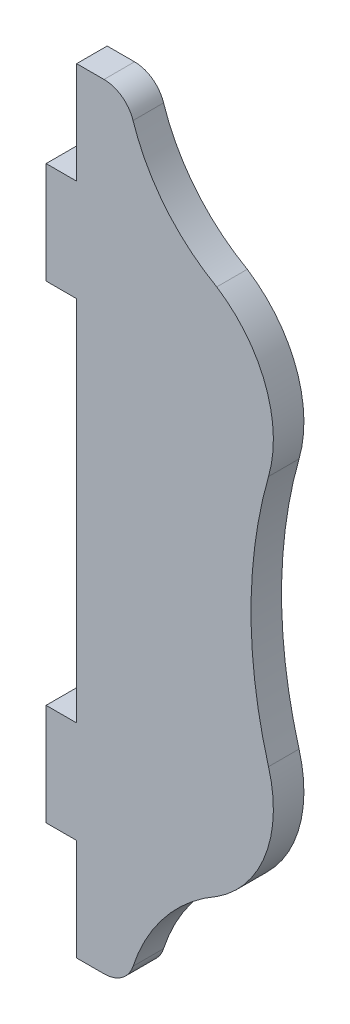
ISO-10303-21;
HEADER;
FILE_DESCRIPTION(('STEP AP214'),'2;1');
FILE_NAME('part.step','',(''),(''),'','','');
FILE_SCHEMA(('AUTOMOTIVE_DESIGN { 1 0 10303 214 1 1 1 1 }'));
ENDSEC;
DATA;
#1=APPLICATION_CONTEXT('core data for automotive mechanical design processes');
#2=APPLICATION_PROTOCOL_DEFINITION('international standard','automotive_design',2000,#1);
#3=PRODUCT_CONTEXT('',#1,'mechanical');
#4=PRODUCT('Part','Part','',(#3));
#5=PRODUCT_RELATED_PRODUCT_CATEGORY('part','',(#4));
#6=PRODUCT_DEFINITION_FORMATION('','',#4);
#7=PRODUCT_DEFINITION_CONTEXT('part definition',#1,'design');
#8=PRODUCT_DEFINITION('design','',#6,#7);
#9=PRODUCT_DEFINITION_SHAPE('','',#8);
#10=(LENGTH_UNIT() NAMED_UNIT(*) SI_UNIT(.MILLI.,.METRE.));
#11=(NAMED_UNIT(*) PLANE_ANGLE_UNIT() SI_UNIT($,.RADIAN.));
#12=(NAMED_UNIT(*) SI_UNIT($,.STERADIAN.) SOLID_ANGLE_UNIT());
#13=UNCERTAINTY_MEASURE_WITH_UNIT(LENGTH_MEASURE(1.E-05),#10,'distance_accuracy_value','');
#14=(GEOMETRIC_REPRESENTATION_CONTEXT(3) GLOBAL_UNCERTAINTY_ASSIGNED_CONTEXT((#13)) GLOBAL_UNIT_ASSIGNED_CONTEXT((#10,
#11,#12)) REPRESENTATION_CONTEXT('',''));
#15=CARTESIAN_POINT('',(0.,0.,0.));
#16=DIRECTION('',(0.,0.,1.));
#17=DIRECTION('',(1.,0.,0.));
#18=AXIS2_PLACEMENT_3D('',#15,#16,#17);
#19=CARTESIAN_POINT('',(28.178792169495,53.4241314614055,3.));
#20=DIRECTION('',(0.,0.,-1.));
#21=DIRECTION('',(-1.,0.,0.));
#22=AXIS2_PLACEMENT_3D('',#19,#20,#21);
#23=CYLINDRICAL_SURFACE('',#22,3.);
#24=CARTESIAN_POINT('',(28.178792169495,53.4241314614055,0.));
#25=DIRECTION('',(0.,0.,1.));
#26=DIRECTION('',(1.,0.,0.));
#27=AXIS2_PLACEMENT_3D('',#24,#25,#26);
#28=CIRCLE('',#27,3.);
#29=CARTESIAN_POINT('',(31.0304509541719,54.355819271659,0.));
#30=VERTEX_POINT('',#29);
#31=CARTESIAN_POINT('',(28.178792169495,56.4241314614055,0.));
#32=VERTEX_POINT('',#31);
#33=EDGE_CURVE('E189',#30,#32,#28,.T.);
#34=ORIENTED_EDGE('',*,*,#33,.T.);
#35=DIRECTION('',(0.,0.,-1.));
#36=VECTOR('',#35,1.);
#37=CARTESIAN_POINT('',(28.178792169495,56.4241314614055,3.));
#38=LINE('',#37,#36);
#39=CARTESIAN_POINT('',(28.178792169495,56.4241314614055,3.));
#40=VERTEX_POINT('',#39);
#41=EDGE_CURVE('E11',#40,#32,#38,.T.);
#42=ORIENTED_EDGE('',*,*,#41,.F.);
#43=CARTESIAN_POINT('',(28.178792169495,53.4241314614055,3.));
#44=DIRECTION('',(0.,0.,1.));
#45=DIRECTION('',(1.,0.,0.));
#46=AXIS2_PLACEMENT_3D('',#43,#44,#45);
#47=CIRCLE('',#46,3.);
#48=CARTESIAN_POINT('',(31.0304509541719,54.355819271659,3.));
#49=VERTEX_POINT('',#48);
#50=EDGE_CURVE('E223',#49,#40,#47,.T.);
#51=ORIENTED_EDGE('',*,*,#50,.F.);
#52=DIRECTION('',(0.,0.,-1.));
#53=VECTOR('',#52,1.);
#54=CARTESIAN_POINT('',(31.0304509541719,54.355819271659,3.));
#55=LINE('',#54,#53);
#56=EDGE_CURVE('E185',#49,#30,#55,.T.);
#57=ORIENTED_EDGE('',*,*,#56,.T.);
#58=EDGE_LOOP('',(#34,#42,#51,#57));
#59=FACE_BOUND('',#58,.T.);
#60=ADVANCED_FACE('F33',(#59),#23,.T.);
#61=CARTESIAN_POINT('',(25.4887162751569,56.4241314614055,3.));
#62=DIRECTION('',(0.,-1.,0.));
#63=DIRECTION('',(0.,0.,-1.));
#64=AXIS2_PLACEMENT_3D('',#61,#62,#63);
#65=PLANE('',#64);
#66=DIRECTION('',(-1.,0.,0.));
#67=VECTOR('',#66,1.);
#68=CARTESIAN_POINT('',(25.4887162751569,56.4241314614055,0.));
#69=LINE('',#68,#67);
#70=CARTESIAN_POINT('',(25.4887162751569,56.4241314614055,0.));
#71=VERTEX_POINT('',#70);
#72=EDGE_CURVE('E192',#32,#71,#69,.T.);
#73=ORIENTED_EDGE('',*,*,#72,.T.);
#74=DIRECTION('',(0.,0.,-1.));
#75=VECTOR('',#74,1.);
#76=CARTESIAN_POINT('',(25.4887162751569,56.4241314614055,3.));
#77=LINE('',#76,#75);
#78=CARTESIAN_POINT('',(25.4887162751569,56.4241314614055,3.));
#79=VERTEX_POINT('',#78);
#80=EDGE_CURVE('E41',#79,#71,#77,.T.);
#81=ORIENTED_EDGE('',*,*,#80,.F.);
#82=DIRECTION('',(-1.,0.,0.));
#83=VECTOR('',#82,1.);
#84=CARTESIAN_POINT('',(25.4887162751569,56.4241314614055,3.));
#85=LINE('',#84,#83);
#86=EDGE_CURVE('E122',#40,#79,#85,.T.);
#87=ORIENTED_EDGE('',*,*,#86,.F.);
#88=ORIENTED_EDGE('',*,*,#41,.T.);
#89=EDGE_LOOP('',(#73,#81,#87,#88));
#90=FACE_BOUND('',#89,.T.);
#91=ADVANCED_FACE('F331',(#90),#65,.F.);
#92=CARTESIAN_POINT('',(25.4887162751569,46.4241314614055,3.));
#93=DIRECTION('',(1.,0.,0.));
#94=DIRECTION('',(0.,0.,-1.));
#95=AXIS2_PLACEMENT_3D('',#92,#93,#94);
#96=PLANE('',#95);
#97=DIRECTION('',(0.,-1.,0.));
#98=VECTOR('',#97,1.);
#99=CARTESIAN_POINT('',(25.4887162751569,46.4241314614055,0.));
#100=LINE('',#99,#98);
#101=CARTESIAN_POINT('',(25.4887162751569,46.4241314614055,0.));
#102=VERTEX_POINT('',#101);
#103=EDGE_CURVE('E194',#71,#102,#100,.T.);
#104=ORIENTED_EDGE('',*,*,#103,.T.);
#105=DIRECTION('',(0.,0.,-1.));
#106=VECTOR('',#105,1.);
#107=CARTESIAN_POINT('',(25.4887162751569,46.4241314614055,3.));
#108=LINE('',#107,#106);
#109=CARTESIAN_POINT('',(25.4887162751569,46.4241314614055,3.));
#110=VERTEX_POINT('',#109);
#111=EDGE_CURVE('E260',#110,#102,#108,.T.);
#112=ORIENTED_EDGE('',*,*,#111,.F.);
#113=DIRECTION('',(0.,-1.,0.));
#114=VECTOR('',#113,1.);
#115=CARTESIAN_POINT('',(25.4887162751569,46.4241314614055,3.));
#116=LINE('',#115,#114);
#117=EDGE_CURVE('E268',#79,#110,#116,.T.);
#118=ORIENTED_EDGE('',*,*,#117,.F.);
#119=ORIENTED_EDGE('',*,*,#80,.T.);
#120=EDGE_LOOP('',(#104,#112,#118,#119));
#121=FACE_BOUND('',#120,.T.);
#122=ADVANCED_FACE('F266',(#121),#96,.F.);
#123=CARTESIAN_POINT('',(22.4887162751569,46.4241314614055,3.));
#124=DIRECTION('',(0.,-1.,0.));
#125=DIRECTION('',(0.,0.,-1.));
#126=AXIS2_PLACEMENT_3D('',#123,#124,#125);
#127=PLANE('',#126);
#128=DIRECTION('',(-1.,0.,0.));
#129=VECTOR('',#128,1.);
#130=CARTESIAN_POINT('',(22.4887162751569,46.4241314614055,0.));
#131=LINE('',#130,#129);
#132=CARTESIAN_POINT('',(22.4887162751569,46.4241314614055,0.));
#133=VERTEX_POINT('',#132);
#134=EDGE_CURVE('E196',#102,#133,#131,.T.);
#135=ORIENTED_EDGE('',*,*,#134,.T.);
#136=DIRECTION('',(0.,0.,-1.));
#137=VECTOR('',#136,1.);
#138=CARTESIAN_POINT('',(22.4887162751569,46.4241314614055,3.));
#139=LINE('',#138,#137);
#140=CARTESIAN_POINT('',(22.4887162751569,46.4241314614055,3.));
#141=VERTEX_POINT('',#140);
#142=EDGE_CURVE('E257',#141,#133,#139,.T.);
#143=ORIENTED_EDGE('',*,*,#142,.F.);
#144=DIRECTION('',(-1.,0.,0.));
#145=VECTOR('',#144,1.);
#146=CARTESIAN_POINT('',(22.4887162751569,46.4241314614055,3.));
#147=LINE('',#146,#145);
#148=EDGE_CURVE('E286',#110,#141,#147,.T.);
#149=ORIENTED_EDGE('',*,*,#148,.F.);
#150=ORIENTED_EDGE('',*,*,#111,.T.);
#151=EDGE_LOOP('',(#135,#143,#149,#150));
#152=FACE_BOUND('',#151,.T.);
#153=ADVANCED_FACE('F277',(#152),#127,.F.);
#154=CARTESIAN_POINT('',(22.4887162751569,46.4241314614055,3.));
#155=DIRECTION('',(1.,0.,0.));
#156=DIRECTION('',(0.,0.,-1.));
#157=AXIS2_PLACEMENT_3D('',#154,#155,#156);
#158=PLANE('',#157);
#159=DIRECTION('',(0.,-1.,0.));
#160=VECTOR('',#159,1.);
#161=CARTESIAN_POINT('',(22.4887162751569,46.4241314614055,0.));
#162=LINE('',#161,#160);
#163=CARTESIAN_POINT('',(22.4887162751569,36.4241314614055,0.));
#164=VERTEX_POINT('',#163);
#165=EDGE_CURVE('E198',#133,#164,#162,.T.);
#166=ORIENTED_EDGE('',*,*,#165,.T.);
#167=DIRECTION('',(0.,0.,-1.));
#168=VECTOR('',#167,1.);
#169=CARTESIAN_POINT('',(22.4887162751569,36.4241314614055,3.));
#170=LINE('',#169,#168);
#171=CARTESIAN_POINT('',(22.4887162751569,36.4241314614055,3.));
#172=VERTEX_POINT('',#171);
#173=EDGE_CURVE('E254',#172,#164,#170,.T.);
#174=ORIENTED_EDGE('',*,*,#173,.F.);
#175=DIRECTION('',(0.,-1.,0.));
#176=VECTOR('',#175,1.);
#177=CARTESIAN_POINT('',(22.4887162751569,46.4241314614055,3.));
#178=LINE('',#177,#176);
#179=EDGE_CURVE('E283',#141,#172,#178,.T.);
#180=ORIENTED_EDGE('',*,*,#179,.F.);
#181=ORIENTED_EDGE('',*,*,#142,.T.);
#182=EDGE_LOOP('',(#166,#174,#180,#181));
#183=FACE_BOUND('',#182,.T.);
#184=ADVANCED_FACE('F281',(#183),#158,.F.);
#185=CARTESIAN_POINT('',(25.4887162751569,36.4241314614055,3.));
#186=DIRECTION('',(0.,1.,0.));
#187=DIRECTION('',(0.,0.,1.));
#188=AXIS2_PLACEMENT_3D('',#185,#186,#187);
#189=PLANE('',#188);
#190=DIRECTION('',(1.,0.,0.));
#191=VECTOR('',#190,1.);
#192=CARTESIAN_POINT('',(25.4887162751569,36.4241314614055,0.));
#193=LINE('',#192,#191);
#194=CARTESIAN_POINT('',(25.4887162751569,36.4241314614055,0.));
#195=VERTEX_POINT('',#194);
#196=EDGE_CURVE('E200',#164,#195,#193,.T.);
#197=ORIENTED_EDGE('',*,*,#196,.T.);
#198=DIRECTION('',(0.,0.,-1.));
#199=VECTOR('',#198,1.);
#200=CARTESIAN_POINT('',(25.4887162751569,36.4241314614055,3.));
#201=LINE('',#200,#199);
#202=CARTESIAN_POINT('',(25.4887162751569,36.4241314614055,3.));
#203=VERTEX_POINT('',#202);
#204=EDGE_CURVE('E251',#203,#195,#201,.T.);
#205=ORIENTED_EDGE('',*,*,#204,.F.);
#206=DIRECTION('',(1.,0.,0.));
#207=VECTOR('',#206,1.);
#208=CARTESIAN_POINT('',(25.4887162751569,36.4241314614055,3.));
#209=LINE('',#208,#207);
#210=EDGE_CURVE('E285',#172,#203,#209,.T.);
#211=ORIENTED_EDGE('',*,*,#210,.F.);
#212=ORIENTED_EDGE('',*,*,#173,.T.);
#213=EDGE_LOOP('',(#197,#205,#211,#212));
#214=FACE_BOUND('',#213,.T.);
#215=ADVANCED_FACE('F344',(#214),#189,.F.);
#216=CARTESIAN_POINT('',(25.4887162751569,0.331580538594416,3.));
#217=DIRECTION('',(1.,0.,0.));
#218=DIRECTION('',(0.,0.,-1.));
#219=AXIS2_PLACEMENT_3D('',#216,#217,#218);
#220=PLANE('',#219);
#221=DIRECTION('',(0.,-1.,0.));
#222=VECTOR('',#221,1.);
#223=CARTESIAN_POINT('',(25.4887162751569,0.331580538594416,0.));
#224=LINE('',#223,#222);
#225=CARTESIAN_POINT('',(25.4887162751569,0.331580538594416,0.));
#226=VERTEX_POINT('',#225);
#227=EDGE_CURVE('E202',#195,#226,#224,.T.);
#228=ORIENTED_EDGE('',*,*,#227,.T.);
#229=DIRECTION('',(0.,0.,-1.));
#230=VECTOR('',#229,1.);
#231=CARTESIAN_POINT('',(25.4887162751569,0.331580538594416,3.));
#232=LINE('',#231,#230);
#233=CARTESIAN_POINT('',(25.4887162751569,0.331580538594416,3.));
#234=VERTEX_POINT('',#233);
#235=EDGE_CURVE('E248',#234,#226,#232,.T.);
#236=ORIENTED_EDGE('',*,*,#235,.F.);
#237=DIRECTION('',(0.,-1.,0.));
#238=VECTOR('',#237,1.);
#239=CARTESIAN_POINT('',(25.4887162751569,0.331580538594416,3.));
#240=LINE('',#239,#238);
#241=EDGE_CURVE('E288',#203,#234,#240,.T.);
#242=ORIENTED_EDGE('',*,*,#241,.F.);
#243=ORIENTED_EDGE('',*,*,#204,.T.);
#244=EDGE_LOOP('',(#228,#236,#242,#243));
#245=FACE_BOUND('',#244,.T.);
#246=ADVANCED_FACE('F347',(#245),#220,.F.);
#247=CARTESIAN_POINT('',(25.4887162751569,0.331580538594416,3.));
#248=DIRECTION('',(0.,-1.,0.));
#249=DIRECTION('',(0.,0.,-1.));
#250=AXIS2_PLACEMENT_3D('',#247,#248,#249);
#251=PLANE('',#250);
#252=DIRECTION('',(-1.,0.,0.));
#253=VECTOR('',#252,1.);
#254=CARTESIAN_POINT('',(25.4887162751569,0.331580538594416,0.));
#255=LINE('',#254,#253);
#256=CARTESIAN_POINT('',(22.4887162751569,0.331580538594416,0.));
#257=VERTEX_POINT('',#256);
#258=EDGE_CURVE('E204',#226,#257,#255,.T.);
#259=ORIENTED_EDGE('',*,*,#258,.T.);
#260=DIRECTION('',(0.,0.,-1.));
#261=VECTOR('',#260,1.);
#262=CARTESIAN_POINT('',(22.4887162751569,0.331580538594416,3.));
#263=LINE('',#262,#261);
#264=CARTESIAN_POINT('',(22.4887162751569,0.331580538594416,3.));
#265=VERTEX_POINT('',#264);
#266=EDGE_CURVE('E245',#265,#257,#263,.T.);
#267=ORIENTED_EDGE('',*,*,#266,.F.);
#268=DIRECTION('',(-1.,0.,0.));
#269=VECTOR('',#268,1.);
#270=CARTESIAN_POINT('',(25.4887162751569,0.331580538594416,3.));
#271=LINE('',#270,#269);
#272=EDGE_CURVE('E294',#234,#265,#271,.T.);
#273=ORIENTED_EDGE('',*,*,#272,.F.);
#274=ORIENTED_EDGE('',*,*,#235,.T.);
#275=EDGE_LOOP('',(#259,#267,#273,#274));
#276=FACE_BOUND('',#275,.T.);
#277=ADVANCED_FACE('F351',(#276),#251,.F.);
#278=CARTESIAN_POINT('',(22.4887162751569,-9.66841946140556,3.));
#279=DIRECTION('',(1.,0.,0.));
#280=DIRECTION('',(0.,1.,0.));
#281=AXIS2_PLACEMENT_3D('',#278,#279,#280);
#282=PLANE('',#281);
#283=DIRECTION('',(0.,-1.,0.));
#284=VECTOR('',#283,1.);
#285=CARTESIAN_POINT('',(22.4887162751569,-9.66841946140556,0.));
#286=LINE('',#285,#284);
#287=CARTESIAN_POINT('',(22.4887162751569,-9.66841946140556,0.));
#288=VERTEX_POINT('',#287);
#289=EDGE_CURVE('E206',#257,#288,#286,.T.);
#290=ORIENTED_EDGE('',*,*,#289,.T.);
#291=DIRECTION('',(0.,0.,-1.));
#292=VECTOR('',#291,1.);
#293=CARTESIAN_POINT('',(22.4887162751569,-9.66841946140556,3.));
#294=LINE('',#293,#292);
#295=CARTESIAN_POINT('',(22.4887162751569,-9.66841946140556,3.));
#296=VERTEX_POINT('',#295);
#297=EDGE_CURVE('E242',#296,#288,#294,.T.);
#298=ORIENTED_EDGE('',*,*,#297,.F.);
#299=DIRECTION('',(0.,-1.,0.));
#300=VECTOR('',#299,1.);
#301=CARTESIAN_POINT('',(22.4887162751569,-9.66841946140556,3.));
#302=LINE('',#301,#300);
#303=EDGE_CURVE('E296',#265,#296,#302,.T.);
#304=ORIENTED_EDGE('',*,*,#303,.F.);
#305=ORIENTED_EDGE('',*,*,#266,.T.);
#306=EDGE_LOOP('',(#290,#298,#304,#305));
#307=FACE_BOUND('',#306,.T.);
#308=ADVANCED_FACE('F355',(#307),#282,.F.);
#309=CARTESIAN_POINT('',(22.4887162751569,-9.66841946140556,3.));
#310=DIRECTION('',(0.,1.,0.));
#311=DIRECTION('',(0.,0.,1.));
#312=AXIS2_PLACEMENT_3D('',#309,#310,#311);
#313=PLANE('',#312);
#314=DIRECTION('',(1.,0.,0.));
#315=VECTOR('',#314,1.);
#316=CARTESIAN_POINT('',(22.4887162751569,-9.66841946140556,0.));
#317=LINE('',#316,#315);
#318=CARTESIAN_POINT('',(25.4887162751569,-9.66841946140556,0.));
#319=VERTEX_POINT('',#318);
#320=EDGE_CURVE('E208',#288,#319,#317,.T.);
#321=ORIENTED_EDGE('',*,*,#320,.T.);
#322=DIRECTION('',(0.,0.,-1.));
#323=VECTOR('',#322,1.);
#324=CARTESIAN_POINT('',(25.4887162751569,-9.66841946140556,3.));
#325=LINE('',#324,#323);
#326=CARTESIAN_POINT('',(25.4887162751569,-9.66841946140556,3.));
#327=VERTEX_POINT('',#326);
#328=EDGE_CURVE('E239',#327,#319,#325,.T.);
#329=ORIENTED_EDGE('',*,*,#328,.F.);
#330=DIRECTION('',(1.,0.,0.));
#331=VECTOR('',#330,1.);
#332=CARTESIAN_POINT('',(22.4887162751569,-9.66841946140556,3.));
#333=LINE('',#332,#331);
#334=EDGE_CURVE('E298',#296,#327,#333,.T.);
#335=ORIENTED_EDGE('',*,*,#334,.F.);
#336=ORIENTED_EDGE('',*,*,#297,.T.);
#337=EDGE_LOOP('',(#321,#329,#335,#336));
#338=FACE_BOUND('',#337,.T.);
#339=ADVANCED_FACE('F359',(#338),#313,.F.);
#340=CARTESIAN_POINT('',(25.4887162751569,-9.66841946140556,3.));
#341=DIRECTION('',(1.,0.,0.));
#342=DIRECTION('',(0.,0.,-1.));
#343=AXIS2_PLACEMENT_3D('',#340,#341,#342);
#344=PLANE('',#343);
#345=DIRECTION('',(0.,-1.,0.));
#346=VECTOR('',#345,1.);
#347=CARTESIAN_POINT('',(25.4887162751569,-9.66841946140556,0.));
#348=LINE('',#347,#346);
#349=CARTESIAN_POINT('',(25.4887162751569,-19.6684194614055,0.));
#350=VERTEX_POINT('',#349);
#351=EDGE_CURVE('E210',#319,#350,#348,.T.);
#352=ORIENTED_EDGE('',*,*,#351,.T.);
#353=DIRECTION('',(0.,0.,-1.));
#354=VECTOR('',#353,1.);
#355=CARTESIAN_POINT('',(25.4887162751569,-19.6684194614055,3.));
#356=LINE('',#355,#354);
#357=CARTESIAN_POINT('',(25.4887162751569,-19.6684194614055,3.));
#358=VERTEX_POINT('',#357);
#359=EDGE_CURVE('E236',#358,#350,#356,.T.);
#360=ORIENTED_EDGE('',*,*,#359,.F.);
#361=DIRECTION('',(0.,-1.,0.));
#362=VECTOR('',#361,1.);
#363=CARTESIAN_POINT('',(25.4887162751569,-9.66841946140556,3.));
#364=LINE('',#363,#362);
#365=EDGE_CURVE('E300',#327,#358,#364,.T.);
#366=ORIENTED_EDGE('',*,*,#365,.F.);
#367=ORIENTED_EDGE('',*,*,#328,.T.);
#368=EDGE_LOOP('',(#352,#360,#366,#367));
#369=FACE_BOUND('',#368,.T.);
#370=ADVANCED_FACE('F363',(#369),#344,.F.);
#371=CARTESIAN_POINT('',(25.4887162751569,-19.6684194614055,3.));
#372=DIRECTION('',(0.,1.,0.));
#373=DIRECTION('',(0.,0.,1.));
#374=AXIS2_PLACEMENT_3D('',#371,#372,#373);
#375=PLANE('',#374);
#376=DIRECTION('',(1.,0.,0.));
#377=VECTOR('',#376,1.);
#378=CARTESIAN_POINT('',(25.4887162751569,-19.6684194614055,0.));
#379=LINE('',#378,#377);
#380=CARTESIAN_POINT('',(28.178792169495,-19.6684194614055,0.));
#381=VERTEX_POINT('',#380);
#382=EDGE_CURVE('E212',#350,#381,#379,.T.);
#383=ORIENTED_EDGE('',*,*,#382,.T.);
#384=DIRECTION('',(0.,0.,-1.));
#385=VECTOR('',#384,1.);
#386=CARTESIAN_POINT('',(28.178792169495,-19.6684194614055,3.));
#387=LINE('',#386,#385);
#388=CARTESIAN_POINT('',(28.178792169495,-19.6684194614055,3.));
#389=VERTEX_POINT('',#388);
#390=EDGE_CURVE('E233',#389,#381,#387,.T.);
#391=ORIENTED_EDGE('',*,*,#390,.F.);
#392=DIRECTION('',(1.,0.,0.));
#393=VECTOR('',#392,1.);
#394=CARTESIAN_POINT('',(25.4887162751569,-19.6684194614055,3.));
#395=LINE('',#394,#393);
#396=EDGE_CURVE('E302',#358,#389,#395,.T.);
#397=ORIENTED_EDGE('',*,*,#396,.F.);
#398=ORIENTED_EDGE('',*,*,#359,.T.);
#399=EDGE_LOOP('',(#383,#391,#397,#398));
#400=FACE_BOUND('',#399,.T.);
#401=ADVANCED_FACE('F367',(#400),#375,.F.);
#402=CARTESIAN_POINT('',(28.178792169495,-16.6684194614055,3.));
#403=DIRECTION('',(0.,0.,-1.));
#404=DIRECTION('',(-1.,0.,0.));
#405=AXIS2_PLACEMENT_3D('',#402,#403,#404);
#406=CYLINDRICAL_SURFACE('',#405,3.);
#407=CARTESIAN_POINT('',(28.178792169495,-16.6684194614055,0.));
#408=DIRECTION('',(0.,0.,1.));
#409=DIRECTION('',(1.,0.,0.));
#410=AXIS2_PLACEMENT_3D('',#407,#408,#409);
#411=CIRCLE('',#410,3.);
#412=CARTESIAN_POINT('',(31.030450954172,-17.600107271659,0.));
#413=VERTEX_POINT('',#412);
#414=EDGE_CURVE('E214',#381,#413,#411,.T.);
#415=ORIENTED_EDGE('',*,*,#414,.T.);
#416=DIRECTION('',(0.,0.,-1.));
#417=VECTOR('',#416,1.);
#418=CARTESIAN_POINT('',(31.030450954172,-17.600107271659,3.));
#419=LINE('',#418,#417);
#420=CARTESIAN_POINT('',(31.030450954172,-17.600107271659,3.));
#421=VERTEX_POINT('',#420);
#422=EDGE_CURVE('E230',#421,#413,#419,.T.);
#423=ORIENTED_EDGE('',*,*,#422,.F.);
#424=CARTESIAN_POINT('',(28.178792169495,-16.6684194614055,3.));
#425=DIRECTION('',(0.,0.,1.));
#426=DIRECTION('',(1.,0.,0.));
#427=AXIS2_PLACEMENT_3D('',#424,#425,#426);
#428=CIRCLE('',#427,3.);
#429=EDGE_CURVE('E304',#389,#421,#428,.T.);
#430=ORIENTED_EDGE('',*,*,#429,.F.);
#431=ORIENTED_EDGE('',*,*,#390,.T.);
#432=EDGE_LOOP('',(#415,#423,#430,#431));
#433=FACE_BOUND('',#432,.T.);
#434=ADVANCED_FACE('F371',(#433),#406,.T.);
#435=CARTESIAN_POINT('',(48.0853602868128,-23.1722504802301,3.));
#436=DIRECTION('',(0.,0.,-1.));
#437=DIRECTION('',(-1.,0.,0.));
#438=AXIS2_PLACEMENT_3D('',#435,#436,#437);
#439=CYLINDRICAL_SURFACE('',#438,17.9420933082354);
#440=CARTESIAN_POINT('',(48.0853602868128,-23.1722504802301,0.));
#441=DIRECTION('',(0.,0.,-1.));
#442=DIRECTION('',(1.,0.,0.));
#443=AXIS2_PLACEMENT_3D('',#440,#441,#442);
#444=CIRCLE('',#443,17.9420933082354);
#445=CARTESIAN_POINT('',(39.2524863317003,-7.55498279428319,0.));
#446=VERTEX_POINT('',#445);
#447=EDGE_CURVE('E216',#413,#446,#444,.T.);
#448=ORIENTED_EDGE('',*,*,#447,.T.);
#449=DIRECTION('',(0.,0.,-1.));
#450=VECTOR('',#449,1.);
#451=CARTESIAN_POINT('',(39.2524863317003,-7.55498279428319,3.));
#452=LINE('',#451,#450);
#453=CARTESIAN_POINT('',(39.2524863317003,-7.55498279428319,3.));
#454=VERTEX_POINT('',#453);
#455=EDGE_CURVE('E227',#454,#446,#452,.T.);
#456=ORIENTED_EDGE('',*,*,#455,.F.);
#457=CARTESIAN_POINT('',(48.0853602868128,-23.1722504802301,3.));
#458=DIRECTION('',(0.,0.,-1.));
#459=DIRECTION('',(1.,0.,0.));
#460=AXIS2_PLACEMENT_3D('',#457,#458,#459);
#461=CIRCLE('',#460,17.9420933082354);
#462=EDGE_CURVE('E306',#421,#454,#461,.T.);
#463=ORIENTED_EDGE('',*,*,#462,.F.);
#464=ORIENTED_EDGE('',*,*,#422,.T.);
#465=EDGE_LOOP('',(#448,#456,#463,#464));
#466=FACE_BOUND('',#465,.T.);
#467=ADVANCED_FACE('F312',(#466),#439,.F.);
#468=CARTESIAN_POINT('',(32.6600719105976,2.65859901058533,3.));
#469=DIRECTION('',(0.,0.,-1.));
#470=DIRECTION('',(-1.,0.,0.));
#471=AXIS2_PLACEMENT_3D('',#468,#469,#470);
#472=CYLINDRICAL_SURFACE('',#471,12.1563638142458);
#473=CARTESIAN_POINT('',(32.6600719105976,2.65859901058533,0.));
#474=DIRECTION('',(0.,0.,1.));
#475=DIRECTION('',(1.,0.,0.));
#476=AXIS2_PLACEMENT_3D('',#473,#474,#475);
#477=CIRCLE('',#476,12.1563638142458);
#478=CARTESIAN_POINT('',(44.3380991730944,6.03511503167658,0.));
#479=VERTEX_POINT('',#478);
#480=EDGE_CURVE('E218',#446,#479,#477,.T.);
#481=ORIENTED_EDGE('',*,*,#480,.T.);
#482=DIRECTION('',(0.,0.,-1.));
#483=VECTOR('',#482,1.);
#484=CARTESIAN_POINT('',(44.3380991730944,6.03511503167658,3.));
#485=LINE('',#484,#483);
#486=CARTESIAN_POINT('',(44.3380991730944,6.03511503167658,3.));
#487=VERTEX_POINT('',#486);
#488=EDGE_CURVE('E180',#487,#479,#485,.T.);
#489=ORIENTED_EDGE('',*,*,#488,.F.);
#490=CARTESIAN_POINT('',(32.6600719105976,2.65859901058533,3.));
#491=DIRECTION('',(0.,0.,1.));
#492=DIRECTION('',(1.,0.,0.));
#493=AXIS2_PLACEMENT_3D('',#490,#491,#492);
#494=CIRCLE('',#493,12.1563638142458);
#495=EDGE_CURVE('E171',#454,#487,#494,.T.);
#496=ORIENTED_EDGE('',*,*,#495,.F.);
#497=ORIENTED_EDGE('',*,*,#455,.T.);
#498=EDGE_LOOP('',(#481,#489,#496,#497));
#499=FACE_BOUND('',#498,.T.);
#500=ADVANCED_FACE('F316',(#499),#472,.T.);
#501=CARTESIAN_POINT('',(87.7961625270463,18.377856,3.));
#502=DIRECTION('',(0.,0.,-1.));
#503=DIRECTION('',(-1.,0.,0.));
#504=AXIS2_PLACEMENT_3D('',#501,#502,#503);
#505=CYLINDRICAL_SURFACE('',#504,45.1768361562342);
#506=CARTESIAN_POINT('',(87.7961625270463,18.377856,0.));
#507=DIRECTION('',(0.,0.,-1.));
#508=DIRECTION('',(1.,0.,0.));
#509=AXIS2_PLACEMENT_3D('',#506,#507,#508);
#510=CIRCLE('',#509,45.1768361562342);
#511=CARTESIAN_POINT('',(44.3380991730944,30.7205969683235,0.));
#512=VERTEX_POINT('',#511);
#513=EDGE_CURVE('E179',#479,#512,#510,.T.);
#514=ORIENTED_EDGE('',*,*,#513,.T.);
#515=DIRECTION('',(0.,0.,-1.));
#516=VECTOR('',#515,1.);
#517=CARTESIAN_POINT('',(44.3380991730944,30.7205969683235,3.));
#518=LINE('',#517,#516);
#519=CARTESIAN_POINT('',(44.3380991730944,30.7205969683235,3.));
#520=VERTEX_POINT('',#519);
#521=EDGE_CURVE('E176',#520,#512,#518,.T.);
#522=ORIENTED_EDGE('',*,*,#521,.F.);
#523=CARTESIAN_POINT('',(87.7961625270463,18.377856,3.));
#524=DIRECTION('',(0.,0.,-1.));
#525=DIRECTION('',(1.,0.,0.));
#526=AXIS2_PLACEMENT_3D('',#523,#524,#525);
#527=CIRCLE('',#526,45.1768361562342);
#528=EDGE_CURVE('E165',#487,#520,#527,.T.);
#529=ORIENTED_EDGE('',*,*,#528,.F.);
#530=ORIENTED_EDGE('',*,*,#488,.T.);
#531=EDGE_LOOP('',(#514,#522,#529,#530));
#532=FACE_BOUND('',#531,.T.);
#533=ADVANCED_FACE('F177',(#532),#505,.F.);
#534=CARTESIAN_POINT('',(32.6600719105975,34.0971129894146,3.));
#535=DIRECTION('',(0.,0.,-1.));
#536=DIRECTION('',(-1.,0.,0.));
#537=AXIS2_PLACEMENT_3D('',#534,#535,#536);
#538=CYLINDRICAL_SURFACE('',#537,12.1563638142458);
#539=CARTESIAN_POINT('',(32.6600719105975,34.0971129894146,0.));
#540=DIRECTION('',(0.,0.,1.));
#541=DIRECTION('',(1.,0.,0.));
#542=AXIS2_PLACEMENT_3D('',#539,#540,#541);
#543=CIRCLE('',#542,12.1563638142458);
#544=CARTESIAN_POINT('',(39.2524863317003,44.3106947942831,0.));
#545=VERTEX_POINT('',#544);
#546=EDGE_CURVE('E108',#512,#545,#543,.T.);
#547=ORIENTED_EDGE('',*,*,#546,.T.);
#548=DIRECTION('',(0.,0.,-1.));
#549=VECTOR('',#548,1.);
#550=CARTESIAN_POINT('',(39.2524863317003,44.3106947942831,3.));
#551=LINE('',#550,#549);
#552=CARTESIAN_POINT('',(39.2524863317003,44.3106947942831,3.));
#553=VERTEX_POINT('',#552);
#554=EDGE_CURVE('E181',#553,#545,#551,.T.);
#555=ORIENTED_EDGE('',*,*,#554,.F.);
#556=CARTESIAN_POINT('',(32.6600719105975,34.0971129894146,3.));
#557=DIRECTION('',(0.,0.,1.));
#558=DIRECTION('',(1.,0.,0.));
#559=AXIS2_PLACEMENT_3D('',#556,#557,#558);
#560=CIRCLE('',#559,12.1563638142458);
#561=EDGE_CURVE('E169',#520,#553,#560,.T.);
#562=ORIENTED_EDGE('',*,*,#561,.F.);
#563=ORIENTED_EDGE('',*,*,#521,.T.);
#564=EDGE_LOOP('',(#547,#555,#562,#563));
#565=FACE_BOUND('',#564,.T.);
#566=ADVANCED_FACE('F183',(#565),#538,.T.);
#567=CARTESIAN_POINT('',(48.0853602868128,59.92796248023,3.));
#568=DIRECTION('',(0.,0.,-1.));
#569=DIRECTION('',(-1.,0.,0.));
#570=AXIS2_PLACEMENT_3D('',#567,#568,#569);
#571=CYLINDRICAL_SURFACE('',#570,17.9420933082354);
#572=CARTESIAN_POINT('',(48.0853602868128,59.92796248023,0.));
#573=DIRECTION('',(0.,0.,-1.));
#574=DIRECTION('',(1.,0.,0.));
#575=AXIS2_PLACEMENT_3D('',#572,#573,#574);
#576=CIRCLE('',#575,17.9420933082354);
#577=EDGE_CURVE('E114',#545,#30,#576,.T.);
#578=ORIENTED_EDGE('',*,*,#577,.T.);
#579=ORIENTED_EDGE('',*,*,#56,.F.);
#580=CARTESIAN_POINT('',(48.0853602868128,59.92796248023,3.));
#581=DIRECTION('',(0.,0.,-1.));
#582=DIRECTION('',(1.,0.,0.));
#583=AXIS2_PLACEMENT_3D('',#580,#581,#582);
#584=CIRCLE('',#583,17.9420933082354);
#585=EDGE_CURVE('E49',#553,#49,#584,.T.);
#586=ORIENTED_EDGE('',*,*,#585,.F.);
#587=ORIENTED_EDGE('',*,*,#554,.T.);
#588=EDGE_LOOP('',(#578,#579,#586,#587));
#589=FACE_BOUND('',#588,.T.);
#590=ADVANCED_FACE('F320',(#589),#571,.F.);
#591=CARTESIAN_POINT('',(28.178792169495,53.4241314614055,3.));
#592=DIRECTION('',(0.,0.,1.));
#593=DIRECTION('',(1.,0.,0.));
#594=AXIS2_PLACEMENT_3D('',#591,#592,#593);
#595=PLANE('',#594);
#596=ORIENTED_EDGE('',*,*,#50,.T.);
#597=ORIENTED_EDGE('',*,*,#86,.T.);
#598=ORIENTED_EDGE('',*,*,#117,.T.);
#599=ORIENTED_EDGE('',*,*,#148,.T.);
#600=ORIENTED_EDGE('',*,*,#179,.T.);
#601=ORIENTED_EDGE('',*,*,#210,.T.);
#602=ORIENTED_EDGE('',*,*,#241,.T.);
#603=ORIENTED_EDGE('',*,*,#272,.T.);
#604=ORIENTED_EDGE('',*,*,#303,.T.);
#605=ORIENTED_EDGE('',*,*,#334,.T.);
#606=ORIENTED_EDGE('',*,*,#365,.T.);
#607=ORIENTED_EDGE('',*,*,#396,.T.);
#608=ORIENTED_EDGE('',*,*,#429,.T.);
#609=ORIENTED_EDGE('',*,*,#462,.T.);
#610=ORIENTED_EDGE('',*,*,#495,.T.);
#611=ORIENTED_EDGE('',*,*,#528,.T.);
#612=ORIENTED_EDGE('',*,*,#561,.T.);
#613=ORIENTED_EDGE('',*,*,#585,.T.);
#614=EDGE_LOOP('',(#596,#597,#598,#599,#600,#601,#602,#603,#604,#605,#606,#607,#608,#609,#610,
#611,#612,#613));
#615=FACE_BOUND('',#614,.T.);
#616=ADVANCED_FACE('F167',(#615),#595,.T.);
#617=CARTESIAN_POINT('',(28.178792169495,53.4241314614055,0.));
#618=DIRECTION('',(0.,0.,1.));
#619=DIRECTION('',(1.,0.,0.));
#620=AXIS2_PLACEMENT_3D('',#617,#618,#619);
#621=PLANE('',#620);
#622=ORIENTED_EDGE('',*,*,#33,.F.);
#623=ORIENTED_EDGE('',*,*,#577,.F.);
#624=ORIENTED_EDGE('',*,*,#546,.F.);
#625=ORIENTED_EDGE('',*,*,#513,.F.);
#626=ORIENTED_EDGE('',*,*,#480,.F.);
#627=ORIENTED_EDGE('',*,*,#447,.F.);
#628=ORIENTED_EDGE('',*,*,#414,.F.);
#629=ORIENTED_EDGE('',*,*,#382,.F.);
#630=ORIENTED_EDGE('',*,*,#351,.F.);
#631=ORIENTED_EDGE('',*,*,#320,.F.);
#632=ORIENTED_EDGE('',*,*,#289,.F.);
#633=ORIENTED_EDGE('',*,*,#258,.F.);
#634=ORIENTED_EDGE('',*,*,#227,.F.);
#635=ORIENTED_EDGE('',*,*,#196,.F.);
#636=ORIENTED_EDGE('',*,*,#165,.F.);
#637=ORIENTED_EDGE('',*,*,#134,.F.);
#638=ORIENTED_EDGE('',*,*,#103,.F.);
#639=ORIENTED_EDGE('',*,*,#72,.F.);
#640=EDGE_LOOP('',(#622,#623,#624,#625,#626,#627,#628,#629,#630,#631,#632,#633,#634,#635,#636,
#637,#638,#639));
#641=FACE_BOUND('',#640,.T.);
#642=ADVANCED_FACE('F272',(#641),#621,.F.);
#643=CLOSED_SHELL('',(#60,#91,#122,#153,#184,#215,#246,#277,#308,#339,#370,#401,#434,#467,#500,
#533,#566,#590,#616,#642));
#644=MANIFOLD_SOLID_BREP('B2',#643);
#645=ADVANCED_BREP_SHAPE_REPRESENTATION('',(#18,#644),#14);
#646=SHAPE_DEFINITION_REPRESENTATION(#9,#645);
ENDSEC;
END-ISO-10303-21;
